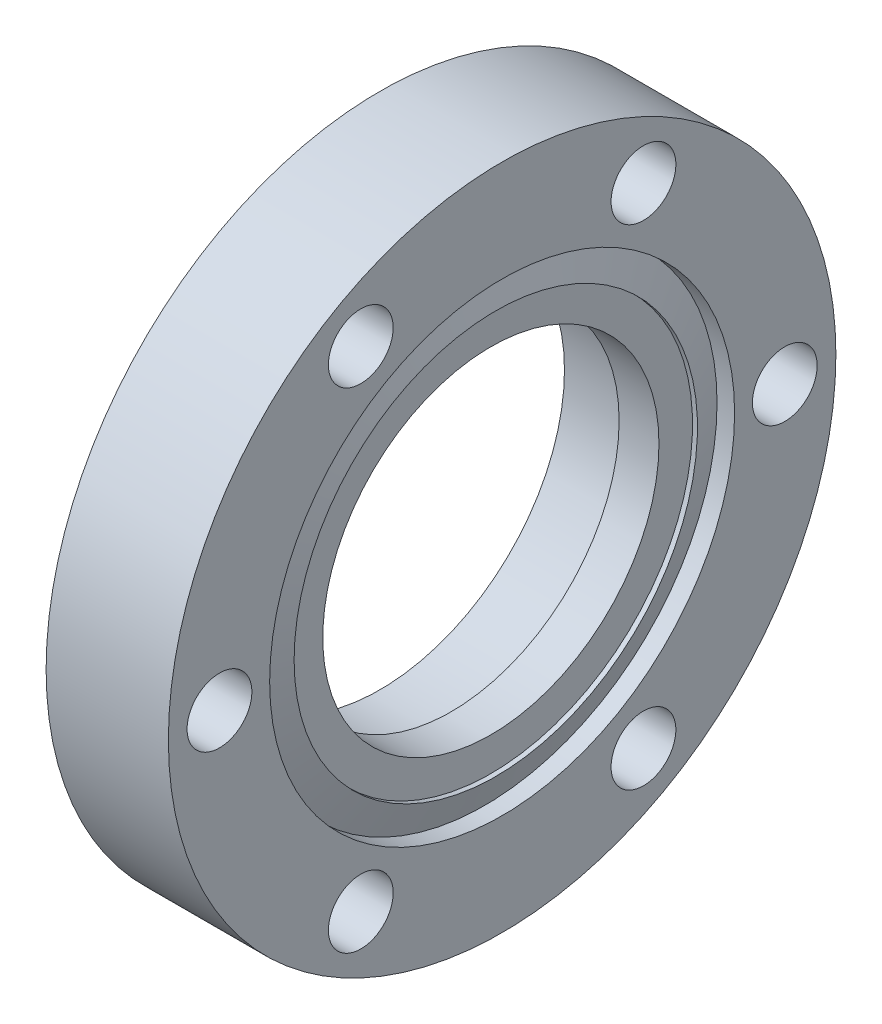
ISO-10303-21;
HEADER;
FILE_DESCRIPTION(('STEP AP214'),'2;1');
FILE_NAME('part.step','',(''),(''),'','','');
FILE_SCHEMA(('AUTOMOTIVE_DESIGN { 1 0 10303 214 1 1 1 1 }'));
ENDSEC;
DATA;
#1=APPLICATION_CONTEXT('core data for automotive mechanical design processes');
#2=APPLICATION_PROTOCOL_DEFINITION('international standard','automotive_design',2000,#1);
#3=PRODUCT_CONTEXT('',#1,'mechanical');
#4=PRODUCT('Part','Part','',(#3));
#5=PRODUCT_RELATED_PRODUCT_CATEGORY('part','',(#4));
#6=PRODUCT_DEFINITION_FORMATION('','',#4);
#7=PRODUCT_DEFINITION_CONTEXT('part definition',#1,'design');
#8=PRODUCT_DEFINITION('design','',#6,#7);
#9=PRODUCT_DEFINITION_SHAPE('','',#8);
#10=(LENGTH_UNIT() NAMED_UNIT(*) SI_UNIT(.MILLI.,.METRE.));
#11=(NAMED_UNIT(*) PLANE_ANGLE_UNIT() SI_UNIT($,.RADIAN.));
#12=(NAMED_UNIT(*) SI_UNIT($,.STERADIAN.) SOLID_ANGLE_UNIT());
#13=UNCERTAINTY_MEASURE_WITH_UNIT(LENGTH_MEASURE(1.E-05),#10,'distance_accuracy_value','');
#14=(GEOMETRIC_REPRESENTATION_CONTEXT(3) GLOBAL_UNCERTAINTY_ASSIGNED_CONTEXT((#13)) GLOBAL_UNIT_ASSIGNED_CONTEXT((#10,
#11,#12)) REPRESENTATION_CONTEXT('',''));
#15=CARTESIAN_POINT('',(0.,0.,0.));
#16=DIRECTION('',(0.,0.,1.));
#17=DIRECTION('',(1.,0.,0.));
#18=AXIS2_PLACEMENT_3D('',#15,#16,#17);
#19=CARTESIAN_POINT('',(6.34999999999937,34.6710000000003,0.));
#20=DIRECTION('',(1.,0.,0.));
#21=DIRECTION('',(0.,0.,-1.));
#22=AXIS2_PLACEMENT_3D('',#19,#20,#21);
#23=PLANE('',#22);
#24=CARTESIAN_POINT('',(6.34999999999937,-25.4285843160799,14.6811999999998));
#25=DIRECTION('',(-1.,0.,0.));
#26=DIRECTION('',(0.,0.,1.));
#27=AXIS2_PLACEMENT_3D('',#24,#25,#26);
#28=CIRCLE('',#27,3.36550000000001);
#29=CARTESIAN_POINT('',(6.34999999999937,-25.4285843160799,18.0466999999998));
#30=VERTEX_POINT('',#29);
#31=EDGE_CURVE('E100',#30,#30,#28,.T.);
#32=ORIENTED_EDGE('',*,*,#31,.T.);
#33=EDGE_LOOP('',(#32));
#34=FACE_BOUND('',#33,.T.);
#35=CARTESIAN_POINT('',(6.34999999999937,25.4285843160799,-14.6811999999998));
#36=DIRECTION('',(-1.,0.,0.));
#37=DIRECTION('',(0.,0.,1.));
#38=AXIS2_PLACEMENT_3D('',#35,#36,#37);
#39=CIRCLE('',#38,3.36550000000001);
#40=CARTESIAN_POINT('',(6.34999999999937,25.4285843160799,-11.3156999999998));
#41=VERTEX_POINT('',#40);
#42=EDGE_CURVE('E82',#41,#41,#39,.T.);
#43=ORIENTED_EDGE('',*,*,#42,.T.);
#44=EDGE_LOOP('',(#43));
#45=FACE_BOUND('',#44,.T.);
#46=CARTESIAN_POINT('',(6.34999999999937,-25.4285843160799,-14.6811999999998));
#47=DIRECTION('',(-1.,0.,0.));
#48=DIRECTION('',(0.,0.,1.));
#49=AXIS2_PLACEMENT_3D('',#46,#47,#48);
#50=CIRCLE('',#49,3.36550000000001);
#51=CARTESIAN_POINT('',(6.34999999999937,-25.4285843160799,-11.3156999999998));
#52=VERTEX_POINT('',#51);
#53=EDGE_CURVE('E76',#52,#52,#50,.T.);
#54=ORIENTED_EDGE('',*,*,#53,.T.);
#55=EDGE_LOOP('',(#54));
#56=FACE_BOUND('',#55,.T.);
#57=CARTESIAN_POINT('',(6.34999999999937,0.,-29.3623999999996));
#58=DIRECTION('',(-1.,0.,0.));
#59=DIRECTION('',(0.,0.,1.));
#60=AXIS2_PLACEMENT_3D('',#57,#58,#59);
#61=CIRCLE('',#60,3.36550000000001);
#62=CARTESIAN_POINT('',(6.34999999999937,0.,-25.9968999999996));
#63=VERTEX_POINT('',#62);
#64=EDGE_CURVE('E70',#63,#63,#61,.T.);
#65=ORIENTED_EDGE('',*,*,#64,.T.);
#66=EDGE_LOOP('',(#65));
#67=FACE_BOUND('',#66,.T.);
#68=CARTESIAN_POINT('',(6.34999999999937,0.,0.));
#69=DIRECTION('',(-1.,0.,0.));
#70=DIRECTION('',(0.,0.,1.));
#71=AXIS2_PLACEMENT_3D('',#68,#69,#70);
#72=CIRCLE('',#71,24.1500000000003);
#73=CARTESIAN_POINT('',(6.34999999999937,0.,24.1500000000003));
#74=VERTEX_POINT('',#73);
#75=EDGE_CURVE('E43',#74,#74,#72,.T.);
#76=ORIENTED_EDGE('',*,*,#75,.T.);
#77=EDGE_LOOP('',(#76));
#78=FACE_BOUND('',#77,.T.);
#79=CARTESIAN_POINT('',(6.34999999999937,0.,0.));
#80=DIRECTION('',(-1.,0.,0.));
#81=DIRECTION('',(0.,0.,1.));
#82=AXIS2_PLACEMENT_3D('',#79,#80,#81);
#83=CIRCLE('',#82,34.6710000000003);
#84=CARTESIAN_POINT('',(6.34999999999937,0.,34.6710000000003));
#85=VERTEX_POINT('',#84);
#86=EDGE_CURVE('E47',#85,#85,#83,.T.);
#87=ORIENTED_EDGE('',*,*,#86,.F.);
#88=EDGE_LOOP('',(#87));
#89=FACE_BOUND('',#88,.T.);
#90=CARTESIAN_POINT('',(6.34999999999937,25.4285843160799,14.6811999999998));
#91=DIRECTION('',(-1.,0.,0.));
#92=DIRECTION('',(0.,0.,1.));
#93=AXIS2_PLACEMENT_3D('',#90,#91,#92);
#94=CIRCLE('',#93,3.36550000000001);
#95=CARTESIAN_POINT('',(6.34999999999937,25.4285843160799,18.0466999999998));
#96=VERTEX_POINT('',#95);
#97=EDGE_CURVE('E88',#96,#96,#94,.T.);
#98=ORIENTED_EDGE('',*,*,#97,.T.);
#99=EDGE_LOOP('',(#98));
#100=FACE_BOUND('',#99,.T.);
#101=CARTESIAN_POINT('',(6.34999999999937,0.,29.3623999999996));
#102=DIRECTION('',(-1.,0.,0.));
#103=DIRECTION('',(0.,0.,1.));
#104=AXIS2_PLACEMENT_3D('',#101,#102,#103);
#105=CIRCLE('',#104,3.36550000000001);
#106=CARTESIAN_POINT('',(6.34999999999937,0.,32.7278999999997));
#107=VERTEX_POINT('',#106);
#108=EDGE_CURVE('E94',#107,#107,#105,.T.);
#109=ORIENTED_EDGE('',*,*,#108,.T.);
#110=EDGE_LOOP('',(#109));
#111=FACE_BOUND('',#110,.T.);
#112=ADVANCED_FACE('F32',(#34,#45,#56,#67,#78,#89,#100,#111),#23,.T.);
#113=CARTESIAN_POINT('',(6.34999999999937,0.,0.));
#114=DIRECTION('',(-1.,0.,0.));
#115=DIRECTION('',(0.,0.,1.));
#116=AXIS2_PLACEMENT_3D('',#113,#114,#115);
#117=CYLINDRICAL_SURFACE('',#116,20.950000000001);
#118=CARTESIAN_POINT('',(5.18000000000051,0.,0.));
#119=DIRECTION('',(-1.,0.,0.));
#120=DIRECTION('',(0.,0.,1.));
#121=AXIS2_PLACEMENT_3D('',#118,#119,#120);
#122=CIRCLE('',#121,20.950000000001);
#123=CARTESIAN_POINT('',(5.18000000000051,0.,20.950000000001));
#124=VERTEX_POINT('',#123);
#125=EDGE_CURVE('E55',#124,#124,#122,.T.);
#126=ORIENTED_EDGE('',*,*,#125,.T.);
#127=EDGE_LOOP('',(#126));
#128=FACE_BOUND('',#127,.T.);
#129=CARTESIAN_POINT('',(5.69000000223288,0.,0.));
#130=DIRECTION('',(-1.,0.,0.));
#131=DIRECTION('',(0.,0.,1.));
#132=AXIS2_PLACEMENT_3D('',#129,#130,#131);
#133=CIRCLE('',#132,20.950000000001);
#134=CARTESIAN_POINT('',(5.69000000223288,0.,20.950000000001));
#135=VERTEX_POINT('',#134);
#136=EDGE_CURVE('E10',#135,#135,#133,.T.);
#137=ORIENTED_EDGE('',*,*,#136,.F.);
#138=EDGE_LOOP('',(#137));
#139=FACE_BOUND('',#138,.T.);
#140=ADVANCED_FACE('F34',(#128,#139),#117,.F.);
#141=CARTESIAN_POINT('',(4.52529524781801,0.,0.));
#142=DIRECTION('',(-1.,0.,0.));
#143=DIRECTION('',(0.,0.,1.));
#144=AXIS2_PLACEMENT_3D('',#141,#142,#143);
#145=CONICAL_SURFACE('',#144,24.1500000000003,1.22173047508163);
#146=ORIENTED_EDGE('',*,*,#136,.T.);
#147=EDGE_LOOP('',(#146));
#148=FACE_BOUND('',#147,.T.);
#149=CARTESIAN_POINT('',(4.52529524781801,0.,0.));
#150=DIRECTION('',(-1.,0.,0.));
#151=DIRECTION('',(0.,0.,1.));
#152=AXIS2_PLACEMENT_3D('',#149,#150,#151);
#153=CIRCLE('',#152,24.1500000000003);
#154=CARTESIAN_POINT('',(4.52529524781801,0.,24.1500000000003));
#155=VERTEX_POINT('',#154);
#156=EDGE_CURVE('E39',#155,#155,#153,.T.);
#157=ORIENTED_EDGE('',*,*,#156,.F.);
#158=EDGE_LOOP('',(#157));
#159=FACE_BOUND('',#158,.T.);
#160=ADVANCED_FACE('F136',(#148,#159),#145,.T.);
#161=CARTESIAN_POINT('',(6.34999999999937,0.,0.));
#162=DIRECTION('',(-1.,0.,0.));
#163=DIRECTION('',(0.,0.,1.));
#164=AXIS2_PLACEMENT_3D('',#161,#162,#163);
#165=CYLINDRICAL_SURFACE('',#164,24.1500000000003);
#166=ORIENTED_EDGE('',*,*,#156,.T.);
#167=EDGE_LOOP('',(#166));
#168=FACE_BOUND('',#167,.T.);
#169=ORIENTED_EDGE('',*,*,#75,.F.);
#170=EDGE_LOOP('',(#169));
#171=FACE_BOUND('',#170,.T.);
#172=ADVANCED_FACE('F130',(#168,#171),#165,.F.);
#173=CARTESIAN_POINT('',(6.34999999999937,0.,0.));
#174=DIRECTION('',(-1.,0.,0.));
#175=DIRECTION('',(0.,0.,1.));
#176=AXIS2_PLACEMENT_3D('',#173,#174,#175);
#177=CYLINDRICAL_SURFACE('',#176,34.6710000000003);
#178=ORIENTED_EDGE('',*,*,#86,.T.);
#179=EDGE_LOOP('',(#178));
#180=FACE_BOUND('',#179,.T.);
#181=CARTESIAN_POINT('',(-6.34999999999929,0.,0.));
#182=DIRECTION('',(-1.,0.,0.));
#183=DIRECTION('',(0.,0.,1.));
#184=AXIS2_PLACEMENT_3D('',#181,#182,#183);
#185=CIRCLE('',#184,34.6710000000003);
#186=CARTESIAN_POINT('',(-6.34999999999929,0.,34.6710000000003));
#187=VERTEX_POINT('',#186);
#188=EDGE_CURVE('E52',#187,#187,#185,.T.);
#189=ORIENTED_EDGE('',*,*,#188,.F.);
#190=EDGE_LOOP('',(#189));
#191=FACE_BOUND('',#190,.T.);
#192=ADVANCED_FACE('F113',(#180,#191),#177,.T.);
#193=CARTESIAN_POINT('',(-6.34999999999929,0.,0.));
#194=DIRECTION('',(-1.,0.,0.));
#195=DIRECTION('',(0.,0.,1.));
#196=AXIS2_PLACEMENT_3D('',#193,#194,#195);
#197=PLANE('',#196);
#198=CARTESIAN_POINT('',(-6.34999999999929,-25.4285843160799,14.6811999999998));
#199=DIRECTION('',(-1.,0.,0.));
#200=DIRECTION('',(0.,0.,1.));
#201=AXIS2_PLACEMENT_3D('',#198,#199,#200);
#202=CIRCLE('',#201,3.36550000000001);
#203=CARTESIAN_POINT('',(-6.34999999999929,-25.4285843160799,18.0466999999998));
#204=VERTEX_POINT('',#203);
#205=EDGE_CURVE('E103',#204,#204,#202,.T.);
#206=ORIENTED_EDGE('',*,*,#205,.F.);
#207=EDGE_LOOP('',(#206));
#208=FACE_BOUND('',#207,.T.);
#209=CARTESIAN_POINT('',(-6.34999999999929,0.,29.3623999999996));
#210=DIRECTION('',(-1.,0.,0.));
#211=DIRECTION('',(0.,0.,1.));
#212=AXIS2_PLACEMENT_3D('',#209,#210,#211);
#213=CIRCLE('',#212,3.36550000000001);
#214=CARTESIAN_POINT('',(-6.34999999999929,0.,32.7278999999997));
#215=VERTEX_POINT('',#214);
#216=EDGE_CURVE('E97',#215,#215,#213,.T.);
#217=ORIENTED_EDGE('',*,*,#216,.F.);
#218=EDGE_LOOP('',(#217));
#219=FACE_BOUND('',#218,.T.);
#220=CARTESIAN_POINT('',(-6.34999999999929,25.4285843160799,14.6811999999998));
#221=DIRECTION('',(-1.,0.,0.));
#222=DIRECTION('',(0.,0.,1.));
#223=AXIS2_PLACEMENT_3D('',#220,#221,#222);
#224=CIRCLE('',#223,3.36550000000001);
#225=CARTESIAN_POINT('',(-6.34999999999929,25.4285843160799,18.0466999999998));
#226=VERTEX_POINT('',#225);
#227=EDGE_CURVE('E91',#226,#226,#224,.T.);
#228=ORIENTED_EDGE('',*,*,#227,.F.);
#229=EDGE_LOOP('',(#228));
#230=FACE_BOUND('',#229,.T.);
#231=CARTESIAN_POINT('',(-6.34999999999929,25.4285843160799,-14.6811999999998));
#232=DIRECTION('',(-1.,0.,0.));
#233=DIRECTION('',(0.,0.,1.));
#234=AXIS2_PLACEMENT_3D('',#231,#232,#233);
#235=CIRCLE('',#234,3.36550000000001);
#236=CARTESIAN_POINT('',(-6.34999999999929,25.4285843160799,-11.3156999999998));
#237=VERTEX_POINT('',#236);
#238=EDGE_CURVE('E85',#237,#237,#235,.T.);
#239=ORIENTED_EDGE('',*,*,#238,.F.);
#240=EDGE_LOOP('',(#239));
#241=FACE_BOUND('',#240,.T.);
#242=CARTESIAN_POINT('',(-6.34999999999929,-25.4285843160799,-14.6811999999998));
#243=DIRECTION('',(-1.,0.,0.));
#244=DIRECTION('',(0.,0.,1.));
#245=AXIS2_PLACEMENT_3D('',#242,#243,#244);
#246=CIRCLE('',#245,3.36550000000001);
#247=CARTESIAN_POINT('',(-6.34999999999929,-25.4285843160799,-11.3156999999998));
#248=VERTEX_POINT('',#247);
#249=EDGE_CURVE('E79',#248,#248,#246,.T.);
#250=ORIENTED_EDGE('',*,*,#249,.F.);
#251=EDGE_LOOP('',(#250));
#252=FACE_BOUND('',#251,.T.);
#253=CARTESIAN_POINT('',(-6.34999999999929,0.,-29.3623999999996));
#254=DIRECTION('',(-1.,0.,0.));
#255=DIRECTION('',(0.,0.,1.));
#256=AXIS2_PLACEMENT_3D('',#253,#254,#255);
#257=CIRCLE('',#256,3.36550000000001);
#258=CARTESIAN_POINT('',(-6.34999999999929,0.,-25.9968999999996));
#259=VERTEX_POINT('',#258);
#260=EDGE_CURVE('E73',#259,#259,#257,.T.);
#261=ORIENTED_EDGE('',*,*,#260,.F.);
#262=EDGE_LOOP('',(#261));
#263=FACE_BOUND('',#262,.T.);
#264=CARTESIAN_POINT('',(-6.34999999999929,0.,0.));
#265=DIRECTION('',(1.,0.,0.));
#266=DIRECTION('',(0.,0.,-1.));
#267=AXIS2_PLACEMENT_3D('',#264,#265,#266);
#268=CIRCLE('',#267,19.1769999999999);
#269=CARTESIAN_POINT('',(-6.34999999999929,0.,-19.1769999999999));
#270=VERTEX_POINT('',#269);
#271=EDGE_CURVE('E58',#270,#270,#268,.T.);
#272=ORIENTED_EDGE('',*,*,#271,.T.);
#273=EDGE_LOOP('',(#272));
#274=FACE_BOUND('',#273,.T.);
#275=ORIENTED_EDGE('',*,*,#188,.T.);
#276=EDGE_LOOP('',(#275));
#277=FACE_BOUND('',#276,.T.);
#278=ADVANCED_FACE('F109',(#208,#219,#230,#241,#252,#263,#274,#277),#197,.T.);
#279=CARTESIAN_POINT('',(5.18000000000051,20.950000000001,0.));
#280=DIRECTION('',(1.,0.,0.));
#281=DIRECTION('',(0.,0.,-1.));
#282=AXIS2_PLACEMENT_3D('',#279,#280,#281);
#283=PLANE('',#282);
#284=CARTESIAN_POINT('',(5.18000000000051,0.,0.));
#285=DIRECTION('',(1.,0.,0.));
#286=DIRECTION('',(0.,0.,-1.));
#287=AXIS2_PLACEMENT_3D('',#284,#285,#286);
#288=CIRCLE('',#287,17.4625);
#289=CARTESIAN_POINT('',(5.18000000000051,0.,-17.4625));
#290=VERTEX_POINT('',#289);
#291=EDGE_CURVE('E67',#290,#290,#288,.T.);
#292=ORIENTED_EDGE('',*,*,#291,.F.);
#293=EDGE_LOOP('',(#292));
#294=FACE_BOUND('',#293,.T.);
#295=ORIENTED_EDGE('',*,*,#125,.F.);
#296=EDGE_LOOP('',(#295));
#297=FACE_BOUND('',#296,.T.);
#298=ADVANCED_FACE('F112',(#294,#297),#283,.T.);
#299=CARTESIAN_POINT('',(5.18000000000051,0.,0.));
#300=DIRECTION('',(1.,0.,0.));
#301=DIRECTION('',(0.,0.,-1.));
#302=AXIS2_PLACEMENT_3D('',#299,#300,#301);
#303=CYLINDRICAL_SURFACE('',#302,19.1769999999999);
#304=ORIENTED_EDGE('',*,*,#271,.F.);
#305=EDGE_LOOP('',(#304));
#306=FACE_BOUND('',#305,.T.);
#307=CARTESIAN_POINT('',(1.04139999999939,0.,0.));
#308=DIRECTION('',(1.,0.,0.));
#309=DIRECTION('',(0.,0.,-1.));
#310=AXIS2_PLACEMENT_3D('',#307,#308,#309);
#311=CIRCLE('',#310,19.1769999999999);
#312=CARTESIAN_POINT('',(1.04139999999939,0.,-19.1769999999999));
#313=VERTEX_POINT('',#312);
#314=EDGE_CURVE('E61',#313,#313,#311,.T.);
#315=ORIENTED_EDGE('',*,*,#314,.T.);
#316=EDGE_LOOP('',(#315));
#317=FACE_BOUND('',#316,.T.);
#318=ADVANCED_FACE('F170',(#306,#317),#303,.F.);
#319=CARTESIAN_POINT('',(1.04139999999939,19.1769999999999,0.));
#320=DIRECTION('',(1.,0.,0.));
#321=DIRECTION('',(0.,0.,-1.));
#322=AXIS2_PLACEMENT_3D('',#319,#320,#321);
#323=PLANE('',#322);
#324=ORIENTED_EDGE('',*,*,#314,.F.);
#325=EDGE_LOOP('',(#324));
#326=FACE_BOUND('',#325,.T.);
#327=CARTESIAN_POINT('',(1.04139999999939,0.,0.));
#328=DIRECTION('',(1.,0.,0.));
#329=DIRECTION('',(0.,0.,-1.));
#330=AXIS2_PLACEMENT_3D('',#327,#328,#329);
#331=CIRCLE('',#330,17.4625);
#332=CARTESIAN_POINT('',(1.04139999999939,0.,-17.4625));
#333=VERTEX_POINT('',#332);
#334=EDGE_CURVE('E64',#333,#333,#331,.T.);
#335=ORIENTED_EDGE('',*,*,#334,.T.);
#336=EDGE_LOOP('',(#335));
#337=FACE_BOUND('',#336,.T.);
#338=ADVANCED_FACE('F180',(#326,#337),#323,.F.);
#339=CARTESIAN_POINT('',(5.18000000000051,0.,0.));
#340=DIRECTION('',(1.,0.,0.));
#341=DIRECTION('',(0.,0.,-1.));
#342=AXIS2_PLACEMENT_3D('',#339,#340,#341);
#343=CYLINDRICAL_SURFACE('',#342,17.4625);
#344=ORIENTED_EDGE('',*,*,#334,.F.);
#345=EDGE_LOOP('',(#344));
#346=FACE_BOUND('',#345,.T.);
#347=ORIENTED_EDGE('',*,*,#291,.T.);
#348=EDGE_LOOP('',(#347));
#349=FACE_BOUND('',#348,.T.);
#350=ADVANCED_FACE('F190',(#346,#349),#343,.F.);
#351=CARTESIAN_POINT('',(-6.34999999999929,0.,-29.3623999999996));
#352=DIRECTION('',(-1.,0.,0.));
#353=DIRECTION('',(0.,0.,1.));
#354=AXIS2_PLACEMENT_3D('',#351,#352,#353);
#355=CYLINDRICAL_SURFACE('',#354,3.36550000000001);
#356=ORIENTED_EDGE('',*,*,#64,.F.);
#357=EDGE_LOOP('',(#356));
#358=FACE_BOUND('',#357,.T.);
#359=ORIENTED_EDGE('',*,*,#260,.T.);
#360=EDGE_LOOP('',(#359));
#361=FACE_BOUND('',#360,.T.);
#362=ADVANCED_FACE('F199',(#358,#361),#355,.F.);
#363=CARTESIAN_POINT('',(-6.34999999999929,-25.4285843160799,-14.6811999999998));
#364=DIRECTION('',(-1.,0.,0.));
#365=DIRECTION('',(0.,0.,1.));
#366=AXIS2_PLACEMENT_3D('',#363,#364,#365);
#367=CYLINDRICAL_SURFACE('',#366,3.36550000000001);
#368=ORIENTED_EDGE('',*,*,#53,.F.);
#369=EDGE_LOOP('',(#368));
#370=FACE_BOUND('',#369,.T.);
#371=ORIENTED_EDGE('',*,*,#249,.T.);
#372=EDGE_LOOP('',(#371));
#373=FACE_BOUND('',#372,.T.);
#374=ADVANCED_FACE('F219',(#370,#373),#367,.F.);
#375=CARTESIAN_POINT('',(-6.34999999999929,25.4285843160799,-14.6811999999998));
#376=DIRECTION('',(-1.,0.,0.));
#377=DIRECTION('',(0.,0.,1.));
#378=AXIS2_PLACEMENT_3D('',#375,#376,#377);
#379=CYLINDRICAL_SURFACE('',#378,3.36550000000001);
#380=ORIENTED_EDGE('',*,*,#42,.F.);
#381=EDGE_LOOP('',(#380));
#382=FACE_BOUND('',#381,.T.);
#383=ORIENTED_EDGE('',*,*,#238,.T.);
#384=EDGE_LOOP('',(#383));
#385=FACE_BOUND('',#384,.T.);
#386=ADVANCED_FACE('F229',(#382,#385),#379,.F.);
#387=CARTESIAN_POINT('',(-6.34999999999929,25.4285843160799,14.6811999999998));
#388=DIRECTION('',(-1.,0.,0.));
#389=DIRECTION('',(0.,0.,1.));
#390=AXIS2_PLACEMENT_3D('',#387,#388,#389);
#391=CYLINDRICAL_SURFACE('',#390,3.36550000000001);
#392=ORIENTED_EDGE('',*,*,#97,.F.);
#393=EDGE_LOOP('',(#392));
#394=FACE_BOUND('',#393,.T.);
#395=ORIENTED_EDGE('',*,*,#227,.T.);
#396=EDGE_LOOP('',(#395));
#397=FACE_BOUND('',#396,.T.);
#398=ADVANCED_FACE('F239',(#394,#397),#391,.F.);
#399=CARTESIAN_POINT('',(-6.34999999999929,0.,29.3623999999996));
#400=DIRECTION('',(-1.,0.,0.));
#401=DIRECTION('',(0.,0.,1.));
#402=AXIS2_PLACEMENT_3D('',#399,#400,#401);
#403=CYLINDRICAL_SURFACE('',#402,3.36550000000001);
#404=ORIENTED_EDGE('',*,*,#108,.F.);
#405=EDGE_LOOP('',(#404));
#406=FACE_BOUND('',#405,.T.);
#407=ORIENTED_EDGE('',*,*,#216,.T.);
#408=EDGE_LOOP('',(#407));
#409=FACE_BOUND('',#408,.T.);
#410=ADVANCED_FACE('F249',(#406,#409),#403,.F.);
#411=CARTESIAN_POINT('',(-6.34999999999929,-25.4285843160799,14.6811999999998));
#412=DIRECTION('',(-1.,0.,0.));
#413=DIRECTION('',(0.,0.,1.));
#414=AXIS2_PLACEMENT_3D('',#411,#412,#413);
#415=CYLINDRICAL_SURFACE('',#414,3.36550000000001);
#416=ORIENTED_EDGE('',*,*,#31,.F.);
#417=EDGE_LOOP('',(#416));
#418=FACE_BOUND('',#417,.T.);
#419=ORIENTED_EDGE('',*,*,#205,.T.);
#420=EDGE_LOOP('',(#419));
#421=FACE_BOUND('',#420,.T.);
#422=ADVANCED_FACE('F107',(#418,#421),#415,.F.);
#423=CLOSED_SHELL('',(#112,#140,#160,#172,#192,#278,#298,#318,#338,#350,#362,#374,#386,#398,
#410,#422));
#424=MANIFOLD_SOLID_BREP('B2',#423);
#425=ADVANCED_BREP_SHAPE_REPRESENTATION('',(#18,#424),#14);
#426=SHAPE_DEFINITION_REPRESENTATION(#9,#425);
ENDSEC;
END-ISO-10303-21;
